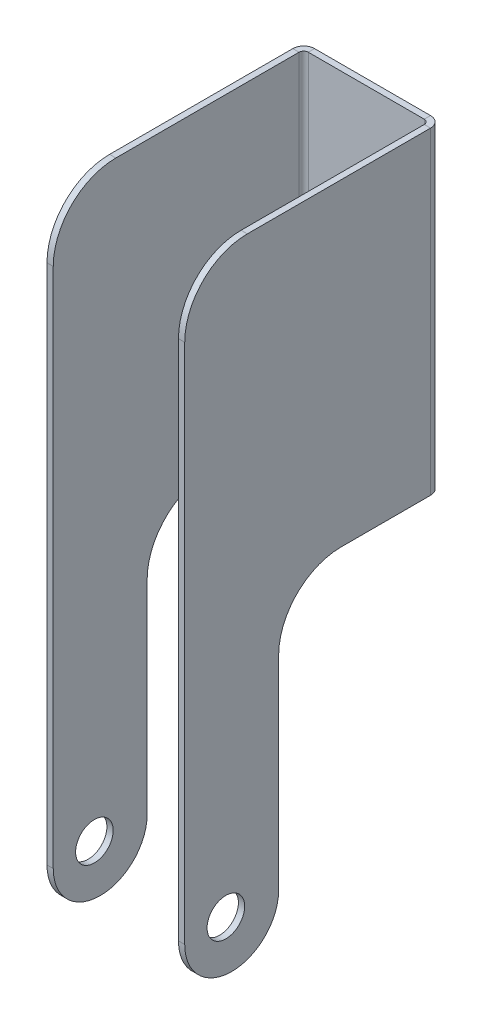
ISO-10303-21;
HEADER;
FILE_DESCRIPTION(('STEP AP214'),'2;1');
FILE_NAME('part.step','',(''),(''),'','','');
FILE_SCHEMA(('AUTOMOTIVE_DESIGN { 1 0 10303 214 1 1 1 1 }'));
ENDSEC;
DATA;
#1=APPLICATION_CONTEXT('core data for automotive mechanical design processes');
#2=APPLICATION_PROTOCOL_DEFINITION('international standard','automotive_design',2000,#1);
#3=PRODUCT_CONTEXT('',#1,'mechanical');
#4=PRODUCT('Part','Part','',(#3));
#5=PRODUCT_RELATED_PRODUCT_CATEGORY('part','',(#4));
#6=PRODUCT_DEFINITION_FORMATION('','',#4);
#7=PRODUCT_DEFINITION_CONTEXT('part definition',#1,'design');
#8=PRODUCT_DEFINITION('design','',#6,#7);
#9=PRODUCT_DEFINITION_SHAPE('','',#8);
#10=(LENGTH_UNIT() NAMED_UNIT(*) SI_UNIT(.MILLI.,.METRE.));
#11=(NAMED_UNIT(*) PLANE_ANGLE_UNIT() SI_UNIT($,.RADIAN.));
#12=(NAMED_UNIT(*) SI_UNIT($,.STERADIAN.) SOLID_ANGLE_UNIT());
#13=UNCERTAINTY_MEASURE_WITH_UNIT(LENGTH_MEASURE(1.E-05),#10,'distance_accuracy_value','');
#14=(GEOMETRIC_REPRESENTATION_CONTEXT(3) GLOBAL_UNCERTAINTY_ASSIGNED_CONTEXT((#13)) GLOBAL_UNIT_ASSIGNED_CONTEXT((#10,
#11,#12)) REPRESENTATION_CONTEXT('',''));
#15=CARTESIAN_POINT('',(0.,0.,0.));
#16=DIRECTION('',(0.,0.,1.));
#17=DIRECTION('',(1.,0.,0.));
#18=AXIS2_PLACEMENT_3D('',#15,#16,#17);
#19=CARTESIAN_POINT('',(11.0000000000001,-25.4,40.));
#20=DIRECTION('',(0.,1.,0.));
#21=DIRECTION('',(0.,0.,1.));
#22=AXIS2_PLACEMENT_3D('',#19,#20,#21);
#23=PLANE('',#22);
#24=DIRECTION('',(0.,0.,-1.));
#25=VECTOR('',#24,1.);
#26=CARTESIAN_POINT('',(11.0000000000001,-25.4,40.));
#27=LINE('',#26,#25);
#28=CARTESIAN_POINT('',(11.0000000000001,-25.4,15.));
#29=VERTEX_POINT('',#28);
#30=CARTESIAN_POINT('',(11.,-25.4,0.736599999999993));
#31=VERTEX_POINT('',#30);
#32=EDGE_CURVE('E216',#29,#31,#27,.T.);
#33=ORIENTED_EDGE('',*,*,#32,.F.);
#34=DIRECTION('',(1.,0.,0.));
#35=VECTOR('',#34,1.);
#36=CARTESIAN_POINT('',(10.0000000000001,-25.4,15.));
#37=LINE('',#36,#35);
#38=CARTESIAN_POINT('',(10.0000000000001,-25.4,15.));
#39=VERTEX_POINT('',#38);
#40=EDGE_CURVE('E316',#29,#39,#37,.F.);
#41=ORIENTED_EDGE('',*,*,#40,.T.);
#42=DIRECTION('',(0.,0.,-1.));
#43=VECTOR('',#42,1.);
#44=CARTESIAN_POINT('',(10.0000000000001,-25.4,40.));
#45=LINE('',#44,#43);
#46=CARTESIAN_POINT('',(10.,-25.4,0.736599999999997));
#47=VERTEX_POINT('',#46);
#48=EDGE_CURVE('E223',#39,#47,#45,.T.);
#49=ORIENTED_EDGE('',*,*,#48,.T.);
#50=DIRECTION('',(1.,0.,0.));
#51=VECTOR('',#50,1.);
#52=CARTESIAN_POINT('',(10.,-25.4,0.736599999999997));
#53=LINE('',#52,#51);
#54=EDGE_CURVE('E399',#47,#31,#53,.T.);
#55=ORIENTED_EDGE('',*,*,#54,.T.);
#56=EDGE_LOOP('',(#33,#41,#49,#55));
#57=FACE_BOUND('',#56,.T.);
#58=ADVANCED_FACE('F38',(#57),#23,.F.);
#59=CARTESIAN_POINT('',(0.,0.,-1.));
#60=DIRECTION('',(0.,0.,-1.));
#61=DIRECTION('',(-1.,0.,0.));
#62=AXIS2_PLACEMENT_3D('',#59,#60,#61);
#63=PLANE('',#62);
#64=DIRECTION('',(-1.,0.,0.));
#65=VECTOR('',#64,1.);
#66=CARTESIAN_POINT('',(-10.,25.4,-1.));
#67=LINE('',#66,#65);
#68=CARTESIAN_POINT('',(9.2634,25.4,-1.));
#69=VERTEX_POINT('',#68);
#70=CARTESIAN_POINT('',(-9.2634,25.4,-1.));
#71=VERTEX_POINT('',#70);
#72=EDGE_CURVE('E297',#69,#71,#67,.T.);
#73=ORIENTED_EDGE('',*,*,#72,.F.);
#74=DIRECTION('',(0.,1.,0.));
#75=VECTOR('',#74,1.);
#76=CARTESIAN_POINT('',(9.2634,25.4,-1.));
#77=LINE('',#76,#75);
#78=CARTESIAN_POINT('',(9.2634,-25.4,-1.));
#79=VERTEX_POINT('',#78);
#80=EDGE_CURVE('E193',#69,#79,#77,.F.);
#81=ORIENTED_EDGE('',*,*,#80,.T.);
#82=DIRECTION('',(1.,0.,0.));
#83=VECTOR('',#82,1.);
#84=CARTESIAN_POINT('',(-10.,-25.4,-1.));
#85=LINE('',#84,#83);
#86=CARTESIAN_POINT('',(-9.2634,-25.4,-1.));
#87=VERTEX_POINT('',#86);
#88=EDGE_CURVE('E300',#87,#79,#85,.T.);
#89=ORIENTED_EDGE('',*,*,#88,.F.);
#90=DIRECTION('',(0.,-1.,0.));
#91=VECTOR('',#90,1.);
#92=CARTESIAN_POINT('',(-9.2634,-25.4,-1.));
#93=LINE('',#92,#91);
#94=EDGE_CURVE('E274',#87,#71,#93,.F.);
#95=ORIENTED_EDGE('',*,*,#94,.T.);
#96=EDGE_LOOP('',(#73,#81,#89,#95));
#97=FACE_BOUND('',#96,.T.);
#98=ADVANCED_FACE('F459',(#97),#63,.T.);
#99=CARTESIAN_POINT('',(0.,0.,0.));
#100=DIRECTION('',(0.,0.,-1.));
#101=DIRECTION('',(-1.,0.,0.));
#102=AXIS2_PLACEMENT_3D('',#99,#100,#101);
#103=PLANE('',#102);
#104=DIRECTION('',(0.,1.,0.));
#105=VECTOR('',#104,1.);
#106=CARTESIAN_POINT('',(9.2634,25.4,0.));
#107=LINE('',#106,#105);
#108=CARTESIAN_POINT('',(9.2634,25.4,0.));
#109=VERTEX_POINT('',#108);
#110=CARTESIAN_POINT('',(9.2634,-25.4,0.));
#111=VERTEX_POINT('',#110);
#112=EDGE_CURVE('E241',#109,#111,#107,.F.);
#113=ORIENTED_EDGE('',*,*,#112,.F.);
#114=DIRECTION('',(-1.,0.,0.));
#115=VECTOR('',#114,1.);
#116=CARTESIAN_POINT('',(-10.,25.4,0.));
#117=LINE('',#116,#115);
#118=CARTESIAN_POINT('',(-9.2634,25.4,0.));
#119=VERTEX_POINT('',#118);
#120=EDGE_CURVE('E294',#109,#119,#117,.T.);
#121=ORIENTED_EDGE('',*,*,#120,.T.);
#122=DIRECTION('',(0.,-1.,0.));
#123=VECTOR('',#122,1.);
#124=CARTESIAN_POINT('',(-9.2634,-25.4,0.));
#125=LINE('',#124,#123);
#126=CARTESIAN_POINT('',(-9.2634,-25.4,0.));
#127=VERTEX_POINT('',#126);
#128=EDGE_CURVE('E287',#127,#119,#125,.F.);
#129=ORIENTED_EDGE('',*,*,#128,.F.);
#130=DIRECTION('',(1.,0.,0.));
#131=VECTOR('',#130,1.);
#132=CARTESIAN_POINT('',(-10.,-25.4,0.));
#133=LINE('',#132,#131);
#134=EDGE_CURVE('E301',#127,#111,#133,.T.);
#135=ORIENTED_EDGE('',*,*,#134,.T.);
#136=EDGE_LOOP('',(#113,#121,#129,#135));
#137=FACE_BOUND('',#136,.T.);
#138=ADVANCED_FACE('F464',(#137),#103,.F.);
#139=CARTESIAN_POINT('',(-10.,25.4,-1.));
#140=DIRECTION('',(0.,1.,0.));
#141=DIRECTION('',(0.,0.,1.));
#142=AXIS2_PLACEMENT_3D('',#139,#140,#141);
#143=PLANE('',#142);
#144=ORIENTED_EDGE('',*,*,#120,.F.);
#145=DIRECTION('',(0.,0.,-1.));
#146=VECTOR('',#145,1.);
#147=CARTESIAN_POINT('',(9.2634,25.4,0.));
#148=LINE('',#147,#146);
#149=EDGE_CURVE('E237',#109,#69,#148,.T.);
#150=ORIENTED_EDGE('',*,*,#149,.T.);
#151=ORIENTED_EDGE('',*,*,#72,.T.);
#152=DIRECTION('',(0.,0.,-1.));
#153=VECTOR('',#152,1.);
#154=CARTESIAN_POINT('',(-9.2634,25.4,0.));
#155=LINE('',#154,#153);
#156=EDGE_CURVE('E291',#119,#71,#155,.T.);
#157=ORIENTED_EDGE('',*,*,#156,.F.);
#158=EDGE_LOOP('',(#144,#150,#151,#157));
#159=FACE_BOUND('',#158,.T.);
#160=ADVANCED_FACE('F520',(#159),#143,.T.);
#161=CARTESIAN_POINT('',(-10.,-25.4,-1.));
#162=DIRECTION('',(0.,-1.,0.));
#163=DIRECTION('',(0.,0.,-1.));
#164=AXIS2_PLACEMENT_3D('',#161,#162,#163);
#165=PLANE('',#164);
#166=DIRECTION('',(0.,0.,-1.));
#167=VECTOR('',#166,1.);
#168=CARTESIAN_POINT('',(9.2634,-25.4,0.));
#169=LINE('',#168,#167);
#170=EDGE_CURVE('E244',#111,#79,#169,.T.);
#171=ORIENTED_EDGE('',*,*,#170,.F.);
#172=ORIENTED_EDGE('',*,*,#134,.F.);
#173=DIRECTION('',(0.,0.,-1.));
#174=VECTOR('',#173,1.);
#175=CARTESIAN_POINT('',(-9.2634,-25.4,0.));
#176=LINE('',#175,#174);
#177=EDGE_CURVE('E281',#127,#87,#176,.T.);
#178=ORIENTED_EDGE('',*,*,#177,.T.);
#179=ORIENTED_EDGE('',*,*,#88,.T.);
#180=EDGE_LOOP('',(#171,#172,#178,#179));
#181=FACE_BOUND('',#180,.T.);
#182=ADVANCED_FACE('F513',(#181),#165,.T.);
#183=CARTESIAN_POINT('',(-9.2634,25.4,0.7366));
#184=DIRECTION('',(0.,1.,0.));
#185=DIRECTION('',(0.,0.,1.));
#186=AXIS2_PLACEMENT_3D('',#183,#184,#185);
#187=PLANE('',#186);
#188=DIRECTION('',(-1.,0.,0.));
#189=VECTOR('',#188,1.);
#190=CARTESIAN_POINT('',(-10.,25.4,0.736599999999997));
#191=LINE('',#190,#189);
#192=CARTESIAN_POINT('',(-10.,25.4,0.736599999999997));
#193=VERTEX_POINT('',#192);
#194=CARTESIAN_POINT('',(-11.,25.4,0.736599999999993));
#195=VERTEX_POINT('',#194);
#196=EDGE_CURVE('E247',#193,#195,#191,.T.);
#197=ORIENTED_EDGE('',*,*,#196,.F.);
#198=CARTESIAN_POINT('',(-9.2634,25.4,0.7366));
#199=DIRECTION('',(0.,-1.,0.));
#200=DIRECTION('',(0.,0.,-1.));
#201=AXIS2_PLACEMENT_3D('',#198,#199,#200);
#202=CIRCLE('',#201,0.7366);
#203=EDGE_CURVE('E284',#119,#193,#202,.F.);
#204=ORIENTED_EDGE('',*,*,#203,.F.);
#205=ORIENTED_EDGE('',*,*,#156,.T.);
#206=CARTESIAN_POINT('',(-9.2634,25.4,0.7366));
#207=DIRECTION('',(0.,-1.,0.));
#208=DIRECTION('',(0.,0.,-1.));
#209=AXIS2_PLACEMENT_3D('',#206,#207,#208);
#210=CIRCLE('',#209,1.7366);
#211=EDGE_CURVE('E277',#71,#195,#210,.F.);
#212=ORIENTED_EDGE('',*,*,#211,.T.);
#213=EDGE_LOOP('',(#197,#204,#205,#212));
#214=FACE_BOUND('',#213,.T.);
#215=ADVANCED_FACE('F510',(#214),#187,.T.);
#216=CARTESIAN_POINT('',(-9.2634,-25.4,0.7366));
#217=DIRECTION('',(0.,1.,0.));
#218=DIRECTION('',(0.,0.,1.));
#219=AXIS2_PLACEMENT_3D('',#216,#217,#218);
#220=PLANE('',#219);
#221=CARTESIAN_POINT('',(-9.2634,-25.4,0.7366));
#222=DIRECTION('',(0.,-1.,0.));
#223=DIRECTION('',(0.,0.,-1.));
#224=AXIS2_PLACEMENT_3D('',#221,#222,#223);
#225=CIRCLE('',#224,0.7366);
#226=CARTESIAN_POINT('',(-10.,-25.4,0.736599999999997));
#227=VERTEX_POINT('',#226);
#228=EDGE_CURVE('E268',#227,#127,#225,.T.);
#229=ORIENTED_EDGE('',*,*,#228,.F.);
#230=DIRECTION('',(-1.,0.,0.));
#231=VECTOR('',#230,1.);
#232=CARTESIAN_POINT('',(-10.,-25.4,0.736599999999997));
#233=LINE('',#232,#231);
#234=CARTESIAN_POINT('',(-11.,-25.4,0.736599999999993));
#235=VERTEX_POINT('',#234);
#236=EDGE_CURVE('E251',#227,#235,#233,.T.);
#237=ORIENTED_EDGE('',*,*,#236,.T.);
#238=CARTESIAN_POINT('',(-9.2634,-25.4,0.7366));
#239=DIRECTION('',(0.,-1.,0.));
#240=DIRECTION('',(0.,0.,-1.));
#241=AXIS2_PLACEMENT_3D('',#238,#239,#240);
#242=CIRCLE('',#241,1.7366);
#243=EDGE_CURVE('E278',#235,#87,#242,.T.);
#244=ORIENTED_EDGE('',*,*,#243,.T.);
#245=ORIENTED_EDGE('',*,*,#177,.F.);
#246=EDGE_LOOP('',(#229,#237,#244,#245));
#247=FACE_BOUND('',#246,.T.);
#248=ADVANCED_FACE('F505',(#247),#220,.F.);
#249=CARTESIAN_POINT('',(-9.2634,-25.4,0.7366));
#250=DIRECTION('',(0.,-1.,0.));
#251=DIRECTION('',(-1.,0.,0.));
#252=AXIS2_PLACEMENT_3D('',#249,#250,#251);
#253=CYLINDRICAL_SURFACE('',#252,1.7366);
#254=ORIENTED_EDGE('',*,*,#94,.F.);
#255=ORIENTED_EDGE('',*,*,#243,.F.);
#256=DIRECTION('',(0.,1.,0.));
#257=VECTOR('',#256,1.);
#258=CARTESIAN_POINT('',(-11.,0.,0.736599999999993));
#259=LINE('',#258,#257);
#260=EDGE_CURVE('E254',#235,#195,#259,.T.);
#261=ORIENTED_EDGE('',*,*,#260,.T.);
#262=ORIENTED_EDGE('',*,*,#211,.F.);
#263=EDGE_LOOP('',(#254,#255,#261,#262));
#264=FACE_BOUND('',#263,.T.);
#265=ADVANCED_FACE('F502',(#264),#253,.T.);
#266=CARTESIAN_POINT('',(-9.2634,-25.4,0.7366));
#267=DIRECTION('',(0.,-1.,0.));
#268=DIRECTION('',(-1.,0.,0.));
#269=AXIS2_PLACEMENT_3D('',#266,#267,#268);
#270=CYLINDRICAL_SURFACE('',#269,0.7366);
#271=ORIENTED_EDGE('',*,*,#128,.T.);
#272=ORIENTED_EDGE('',*,*,#203,.T.);
#273=DIRECTION('',(0.,-1.,0.));
#274=VECTOR('',#273,1.);
#275=CARTESIAN_POINT('',(-10.,25.4,0.736599999999997));
#276=LINE('',#275,#274);
#277=EDGE_CURVE('E249',#193,#227,#276,.T.);
#278=ORIENTED_EDGE('',*,*,#277,.T.);
#279=ORIENTED_EDGE('',*,*,#228,.T.);
#280=EDGE_LOOP('',(#271,#272,#278,#279));
#281=FACE_BOUND('',#280,.T.);
#282=ADVANCED_FACE('F500',(#281),#270,.F.);
#283=CARTESIAN_POINT('',(-11.0000000000001,-25.4,40.));
#284=DIRECTION('',(0.,1.,0.));
#285=DIRECTION('',(0.,0.,1.));
#286=AXIS2_PLACEMENT_3D('',#283,#284,#285);
#287=PLANE('',#286);
#288=DIRECTION('',(0.,0.,1.));
#289=VECTOR('',#288,1.);
#290=CARTESIAN_POINT('',(-10.0000000000001,-25.4,40.));
#291=LINE('',#290,#289);
#292=CARTESIAN_POINT('',(-10.,-25.4,15.));
#293=VERTEX_POINT('',#292);
#294=EDGE_CURVE('E259',#227,#293,#291,.T.);
#295=ORIENTED_EDGE('',*,*,#294,.T.);
#296=DIRECTION('',(-1.,0.,0.));
#297=VECTOR('',#296,1.);
#298=CARTESIAN_POINT('',(-11.,-25.4,15.));
#299=LINE('',#298,#297);
#300=CARTESIAN_POINT('',(-11.,-25.4,15.));
#301=VERTEX_POINT('',#300);
#302=EDGE_CURVE('E318',#293,#301,#299,.T.);
#303=ORIENTED_EDGE('',*,*,#302,.T.);
#304=DIRECTION('',(0.,0.,1.));
#305=VECTOR('',#304,1.);
#306=CARTESIAN_POINT('',(-11.0000000000001,-25.4,40.));
#307=LINE('',#306,#305);
#308=EDGE_CURVE('E260',#235,#301,#307,.T.);
#309=ORIENTED_EDGE('',*,*,#308,.F.);
#310=ORIENTED_EDGE('',*,*,#236,.F.);
#311=EDGE_LOOP('',(#295,#303,#309,#310));
#312=FACE_BOUND('',#311,.T.);
#313=ADVANCED_FACE('F493',(#312),#287,.F.);
#314=CARTESIAN_POINT('',(-11.,25.4,0.));
#315=DIRECTION('',(0.,-1.,0.));
#316=DIRECTION('',(0.,0.,-1.));
#317=AXIS2_PLACEMENT_3D('',#314,#315,#316);
#318=PLANE('',#317);
#319=DIRECTION('',(0.,0.,-1.));
#320=VECTOR('',#319,1.);
#321=CARTESIAN_POINT('',(-11.,25.4,0.));
#322=LINE('',#321,#320);
#323=CARTESIAN_POINT('',(-11.0000000000001,25.4,30.));
#324=VERTEX_POINT('',#323);
#325=EDGE_CURVE('E266',#324,#195,#322,.T.);
#326=ORIENTED_EDGE('',*,*,#325,.F.);
#327=DIRECTION('',(1.,0.,0.));
#328=VECTOR('',#327,1.);
#329=CARTESIAN_POINT('',(-11.0000000000001,25.4,30.));
#330=LINE('',#329,#328);
#331=CARTESIAN_POINT('',(-10.0000000000001,25.4,30.));
#332=VERTEX_POINT('',#331);
#333=EDGE_CURVE('E331',#324,#332,#330,.T.);
#334=ORIENTED_EDGE('',*,*,#333,.T.);
#335=DIRECTION('',(0.,0.,-1.));
#336=VECTOR('',#335,1.);
#337=CARTESIAN_POINT('',(-10.,25.4,0.));
#338=LINE('',#337,#336);
#339=EDGE_CURVE('E264',#332,#193,#338,.T.);
#340=ORIENTED_EDGE('',*,*,#339,.T.);
#341=ORIENTED_EDGE('',*,*,#196,.T.);
#342=EDGE_LOOP('',(#326,#334,#340,#341));
#343=FACE_BOUND('',#342,.T.);
#344=ADVANCED_FACE('F486',(#343),#318,.F.);
#345=CARTESIAN_POINT('',(-11.,0.,0.));
#346=DIRECTION('',(1.,0.,0.));
#347=DIRECTION('',(0.,0.,-1.));
#348=AXIS2_PLACEMENT_3D('',#345,#346,#347);
#349=PLANE('',#348);
#350=CARTESIAN_POINT('',(-11.0000000000001,-67.4,33.4285));
#351=DIRECTION('',(-1.,0.,0.));
#352=DIRECTION('',(0.,0.,1.));
#353=AXIS2_PLACEMENT_3D('',#350,#351,#352);
#354=CIRCLE('',#353,3.);
#355=CARTESIAN_POINT('',(-11.0000000000001,-67.4,36.4285));
#356=VERTEX_POINT('',#355);
#357=EDGE_CURVE('E373',#356,#356,#354,.T.);
#358=ORIENTED_EDGE('',*,*,#357,.F.);
#359=EDGE_LOOP('',(#358));
#360=FACE_BOUND('',#359,.T.);
#361=CARTESIAN_POINT('',(-11.0000000000001,-67.9,32.5));
#362=DIRECTION('',(1.,0.,0.));
#363=DIRECTION('',(0.,0.,-1.));
#364=AXIS2_PLACEMENT_3D('',#361,#362,#363);
#365=CIRCLE('',#364,7.5);
#366=CARTESIAN_POINT('',(-11.0000000000001,-67.9,25.));
#367=VERTEX_POINT('',#366);
#368=CARTESIAN_POINT('',(-11.0000000000001,-75.4,32.5));
#369=VERTEX_POINT('',#368);
#370=EDGE_CURVE('E363',#367,#369,#365,.F.);
#371=ORIENTED_EDGE('',*,*,#370,.T.);
#372=CARTESIAN_POINT('',(-11.0000000000001,-67.9,32.5));
#373=DIRECTION('',(1.,0.,0.));
#374=DIRECTION('',(0.,0.,-1.));
#375=AXIS2_PLACEMENT_3D('',#372,#373,#374);
#376=CIRCLE('',#375,7.5);
#377=CARTESIAN_POINT('',(-11.0000000000001,-67.9,40.));
#378=VERTEX_POINT('',#377);
#379=EDGE_CURVE('E365',#369,#378,#376,.F.);
#380=ORIENTED_EDGE('',*,*,#379,.T.);
#381=DIRECTION('',(0.,1.,0.));
#382=VECTOR('',#381,1.);
#383=CARTESIAN_POINT('',(-11.0000000000001,25.4,40.));
#384=LINE('',#383,#382);
#385=CARTESIAN_POINT('',(-11.0000000000001,15.4,40.));
#386=VERTEX_POINT('',#385);
#387=EDGE_CURVE('E263',#378,#386,#384,.T.);
#388=ORIENTED_EDGE('',*,*,#387,.T.);
#389=CARTESIAN_POINT('',(-11.0000000000001,15.4,30.));
#390=DIRECTION('',(1.,0.,0.));
#391=DIRECTION('',(0.,0.,-1.));
#392=AXIS2_PLACEMENT_3D('',#389,#390,#391);
#393=CIRCLE('',#392,10.);
#394=EDGE_CURVE('E340',#386,#324,#393,.F.);
#395=ORIENTED_EDGE('',*,*,#394,.T.);
#396=ORIENTED_EDGE('',*,*,#325,.T.);
#397=ORIENTED_EDGE('',*,*,#260,.F.);
#398=ORIENTED_EDGE('',*,*,#308,.T.);
#399=CARTESIAN_POINT('',(-11.0000000000001,-35.4,15.));
#400=DIRECTION('',(1.,0.,0.));
#401=DIRECTION('',(0.,0.,-1.));
#402=AXIS2_PLACEMENT_3D('',#399,#400,#401);
#403=CIRCLE('',#402,10.);
#404=CARTESIAN_POINT('',(-11.0000000000001,-35.4,25.));
#405=VERTEX_POINT('',#404);
#406=EDGE_CURVE('E346',#301,#405,#403,.T.);
#407=ORIENTED_EDGE('',*,*,#406,.T.);
#408=DIRECTION('',(0.,-1.,0.));
#409=VECTOR('',#408,1.);
#410=CARTESIAN_POINT('',(-11.0000000000001,-75.4,25.));
#411=LINE('',#410,#409);
#412=EDGE_CURVE('E392',#405,#367,#411,.T.);
#413=ORIENTED_EDGE('',*,*,#412,.T.);
#414=EDGE_LOOP('',(#371,#380,#388,#395,#396,#397,#398,#407,#413));
#415=FACE_BOUND('',#414,.T.);
#416=ADVANCED_FACE('F396',(#360,#415),#349,.F.);
#417=CARTESIAN_POINT('',(-10.,0.,0.));
#418=DIRECTION('',(1.,0.,0.));
#419=DIRECTION('',(0.,0.,-1.));
#420=AXIS2_PLACEMENT_3D('',#417,#418,#419);
#421=PLANE('',#420);
#422=CARTESIAN_POINT('',(-10.0000000000001,-67.4,33.4285));
#423=DIRECTION('',(1.,0.,0.));
#424=DIRECTION('',(0.,0.,-1.));
#425=AXIS2_PLACEMENT_3D('',#422,#423,#424);
#426=CIRCLE('',#425,3.);
#427=CARTESIAN_POINT('',(-10.0000000000001,-67.4,30.4285));
#428=VERTEX_POINT('',#427);
#429=EDGE_CURVE('E312',#428,#428,#426,.T.);
#430=ORIENTED_EDGE('',*,*,#429,.F.);
#431=EDGE_LOOP('',(#430));
#432=FACE_BOUND('',#431,.T.);
#433=DIRECTION('',(0.,1.,0.));
#434=VECTOR('',#433,1.);
#435=CARTESIAN_POINT('',(-10.0000000000001,25.4,40.));
#436=LINE('',#435,#434);
#437=CARTESIAN_POINT('',(-10.0000000000001,-67.9,40.));
#438=VERTEX_POINT('',#437);
#439=CARTESIAN_POINT('',(-10.0000000000001,15.4,40.));
#440=VERTEX_POINT('',#439);
#441=EDGE_CURVE('E271',#438,#440,#436,.T.);
#442=ORIENTED_EDGE('',*,*,#441,.F.);
#443=CARTESIAN_POINT('',(-10.0000000000001,-67.9,32.5));
#444=DIRECTION('',(1.,0.,0.));
#445=DIRECTION('',(0.,0.,-1.));
#446=AXIS2_PLACEMENT_3D('',#443,#444,#445);
#447=CIRCLE('',#446,7.5);
#448=CARTESIAN_POINT('',(-10.0000000000001,-75.4,32.5));
#449=VERTEX_POINT('',#448);
#450=EDGE_CURVE('E47',#438,#449,#447,.T.);
#451=ORIENTED_EDGE('',*,*,#450,.T.);
#452=CARTESIAN_POINT('',(-10.0000000000001,-67.9,32.5));
#453=DIRECTION('',(1.,0.,0.));
#454=DIRECTION('',(0.,0.,-1.));
#455=AXIS2_PLACEMENT_3D('',#452,#453,#454);
#456=CIRCLE('',#455,7.5);
#457=CARTESIAN_POINT('',(-10.0000000000001,-67.9,25.));
#458=VERTEX_POINT('',#457);
#459=EDGE_CURVE('E55',#449,#458,#456,.T.);
#460=ORIENTED_EDGE('',*,*,#459,.T.);
#461=DIRECTION('',(0.,-1.,0.));
#462=VECTOR('',#461,1.);
#463=CARTESIAN_POINT('',(-10.0000000000001,-75.4,25.));
#464=LINE('',#463,#462);
#465=CARTESIAN_POINT('',(-10.0000000000001,-35.4,25.));
#466=VERTEX_POINT('',#465);
#467=EDGE_CURVE('E394',#466,#458,#464,.T.);
#468=ORIENTED_EDGE('',*,*,#467,.F.);
#469=CARTESIAN_POINT('',(-10.,-35.4,15.));
#470=DIRECTION('',(1.,0.,0.));
#471=DIRECTION('',(0.,0.,-1.));
#472=AXIS2_PLACEMENT_3D('',#469,#470,#471);
#473=CIRCLE('',#472,10.);
#474=EDGE_CURVE('E348',#466,#293,#473,.F.);
#475=ORIENTED_EDGE('',*,*,#474,.T.);
#476=ORIENTED_EDGE('',*,*,#294,.F.);
#477=ORIENTED_EDGE('',*,*,#277,.F.);
#478=ORIENTED_EDGE('',*,*,#339,.F.);
#479=CARTESIAN_POINT('',(-10.0000000000001,15.4,30.));
#480=DIRECTION('',(1.,0.,0.));
#481=DIRECTION('',(0.,0.,-1.));
#482=AXIS2_PLACEMENT_3D('',#479,#480,#481);
#483=CIRCLE('',#482,10.);
#484=EDGE_CURVE('E334',#332,#440,#483,.T.);
#485=ORIENTED_EDGE('',*,*,#484,.T.);
#486=EDGE_LOOP('',(#442,#451,#460,#468,#475,#476,#477,#478,#485));
#487=FACE_BOUND('',#486,.T.);
#488=ADVANCED_FACE('F485',(#432,#487),#421,.T.);
#489=CARTESIAN_POINT('',(-11.0000000000001,25.4,40.));
#490=DIRECTION('',(0.,0.,-1.));
#491=DIRECTION('',(-1.,0.,0.));
#492=AXIS2_PLACEMENT_3D('',#489,#490,#491);
#493=PLANE('',#492);
#494=ORIENTED_EDGE('',*,*,#387,.F.);
#495=DIRECTION('',(-1.,0.,0.));
#496=VECTOR('',#495,1.);
#497=CARTESIAN_POINT('',(-10.0000000000001,-67.9,40.));
#498=LINE('',#497,#496);
#499=EDGE_CURVE('E367',#378,#438,#498,.F.);
#500=ORIENTED_EDGE('',*,*,#499,.T.);
#501=ORIENTED_EDGE('',*,*,#441,.T.);
#502=DIRECTION('',(1.,0.,0.));
#503=VECTOR('',#502,1.);
#504=CARTESIAN_POINT('',(-11.0000000000001,15.4,40.));
#505=LINE('',#504,#503);
#506=EDGE_CURVE('E337',#440,#386,#505,.F.);
#507=ORIENTED_EDGE('',*,*,#506,.T.);
#508=EDGE_LOOP('',(#494,#500,#501,#507));
#509=FACE_BOUND('',#508,.T.);
#510=ADVANCED_FACE('F480',(#509),#493,.F.);
#511=CARTESIAN_POINT('',(9.2634,-25.4,0.7366));
#512=DIRECTION('',(0.,-1.,0.));
#513=DIRECTION('',(0.,0.,-1.));
#514=AXIS2_PLACEMENT_3D('',#511,#512,#513);
#515=PLANE('',#514);
#516=ORIENTED_EDGE('',*,*,#54,.F.);
#517=CARTESIAN_POINT('',(9.2634,-25.4,0.7366));
#518=DIRECTION('',(0.,1.,0.));
#519=DIRECTION('',(0.,0.,1.));
#520=AXIS2_PLACEMENT_3D('',#517,#518,#519);
#521=CIRCLE('',#520,0.7366);
#522=EDGE_CURVE('E196',#111,#47,#521,.F.);
#523=ORIENTED_EDGE('',*,*,#522,.F.);
#524=ORIENTED_EDGE('',*,*,#170,.T.);
#525=CARTESIAN_POINT('',(9.2634,-25.4,0.7366));
#526=DIRECTION('',(0.,1.,0.));
#527=DIRECTION('',(0.,0.,1.));
#528=AXIS2_PLACEMENT_3D('',#525,#526,#527);
#529=CIRCLE('',#528,1.7366);
#530=EDGE_CURVE('E236',#79,#31,#529,.F.);
#531=ORIENTED_EDGE('',*,*,#530,.T.);
#532=EDGE_LOOP('',(#516,#523,#524,#531));
#533=FACE_BOUND('',#532,.T.);
#534=ADVANCED_FACE('F413',(#533),#515,.T.);
#535=CARTESIAN_POINT('',(9.2634,25.4,0.7366));
#536=DIRECTION('',(0.,-1.,0.));
#537=DIRECTION('',(0.,0.,-1.));
#538=AXIS2_PLACEMENT_3D('',#535,#536,#537);
#539=PLANE('',#538);
#540=CARTESIAN_POINT('',(9.2634,25.4,0.7366));
#541=DIRECTION('',(0.,1.,0.));
#542=DIRECTION('',(0.,0.,1.));
#543=AXIS2_PLACEMENT_3D('',#540,#541,#542);
#544=CIRCLE('',#543,0.7366);
#545=CARTESIAN_POINT('',(10.,25.4,0.736599999999997));
#546=VERTEX_POINT('',#545);
#547=EDGE_CURVE('E203',#546,#109,#544,.T.);
#548=ORIENTED_EDGE('',*,*,#547,.F.);
#549=DIRECTION('',(1.,0.,0.));
#550=VECTOR('',#549,1.);
#551=CARTESIAN_POINT('',(10.,25.4,0.736599999999997));
#552=LINE('',#551,#550);
#553=CARTESIAN_POINT('',(11.,25.4,0.736599999999993));
#554=VERTEX_POINT('',#553);
#555=EDGE_CURVE('E200',#546,#554,#552,.T.);
#556=ORIENTED_EDGE('',*,*,#555,.T.);
#557=CARTESIAN_POINT('',(9.2634,25.4,0.7366));
#558=DIRECTION('',(0.,1.,0.));
#559=DIRECTION('',(0.,0.,1.));
#560=AXIS2_PLACEMENT_3D('',#557,#558,#559);
#561=CIRCLE('',#560,1.7366);
#562=EDGE_CURVE('E186',#554,#69,#561,.T.);
#563=ORIENTED_EDGE('',*,*,#562,.T.);
#564=ORIENTED_EDGE('',*,*,#149,.F.);
#565=EDGE_LOOP('',(#548,#556,#563,#564));
#566=FACE_BOUND('',#565,.T.);
#567=ADVANCED_FACE('F201',(#566),#539,.F.);
#568=CARTESIAN_POINT('',(9.2634,25.4,0.7366));
#569=DIRECTION('',(0.,1.,0.));
#570=DIRECTION('',(1.,0.,0.));
#571=AXIS2_PLACEMENT_3D('',#568,#569,#570);
#572=CYLINDRICAL_SURFACE('',#571,1.7366);
#573=ORIENTED_EDGE('',*,*,#80,.F.);
#574=ORIENTED_EDGE('',*,*,#562,.F.);
#575=DIRECTION('',(0.,1.,0.));
#576=VECTOR('',#575,1.);
#577=CARTESIAN_POINT('',(11.,0.,0.736599999999993));
#578=LINE('',#577,#576);
#579=EDGE_CURVE('E190',#31,#554,#578,.T.);
#580=ORIENTED_EDGE('',*,*,#579,.F.);
#581=ORIENTED_EDGE('',*,*,#530,.F.);
#582=EDGE_LOOP('',(#573,#574,#580,#581));
#583=FACE_BOUND('',#582,.T.);
#584=ADVANCED_FACE('F188',(#583),#572,.T.);
#585=CARTESIAN_POINT('',(9.2634,25.4,0.7366));
#586=DIRECTION('',(0.,1.,0.));
#587=DIRECTION('',(1.,0.,0.));
#588=AXIS2_PLACEMENT_3D('',#585,#586,#587);
#589=CYLINDRICAL_SURFACE('',#588,0.7366);
#590=ORIENTED_EDGE('',*,*,#112,.T.);
#591=ORIENTED_EDGE('',*,*,#522,.T.);
#592=DIRECTION('',(0.,1.,0.));
#593=VECTOR('',#592,1.);
#594=CARTESIAN_POINT('',(10.,-25.4,0.736599999999997));
#595=LINE('',#594,#593);
#596=EDGE_CURVE('E208',#47,#546,#595,.T.);
#597=ORIENTED_EDGE('',*,*,#596,.T.);
#598=ORIENTED_EDGE('',*,*,#547,.T.);
#599=EDGE_LOOP('',(#590,#591,#597,#598));
#600=FACE_BOUND('',#599,.T.);
#601=ADVANCED_FACE('F417',(#600),#589,.F.);
#602=CARTESIAN_POINT('',(11.,25.4,0.));
#603=DIRECTION('',(0.,-1.,0.));
#604=DIRECTION('',(0.,0.,-1.));
#605=AXIS2_PLACEMENT_3D('',#602,#603,#604);
#606=PLANE('',#605);
#607=DIRECTION('',(0.,0.,1.));
#608=VECTOR('',#607,1.);
#609=CARTESIAN_POINT('',(10.,25.4,0.));
#610=LINE('',#609,#608);
#611=CARTESIAN_POINT('',(10.0000000000001,25.4,30.));
#612=VERTEX_POINT('',#611);
#613=EDGE_CURVE('E217',#546,#612,#610,.T.);
#614=ORIENTED_EDGE('',*,*,#613,.T.);
#615=DIRECTION('',(-1.,0.,0.));
#616=VECTOR('',#615,1.);
#617=CARTESIAN_POINT('',(11.0000000000001,25.4,30.));
#618=LINE('',#617,#616);
#619=CARTESIAN_POINT('',(11.0000000000001,25.4,30.));
#620=VERTEX_POINT('',#619);
#621=EDGE_CURVE('E221',#612,#620,#618,.F.);
#622=ORIENTED_EDGE('',*,*,#621,.T.);
#623=DIRECTION('',(0.,0.,1.));
#624=VECTOR('',#623,1.);
#625=CARTESIAN_POINT('',(11.,25.4,0.));
#626=LINE('',#625,#624);
#627=EDGE_CURVE('E213',#554,#620,#626,.T.);
#628=ORIENTED_EDGE('',*,*,#627,.F.);
#629=ORIENTED_EDGE('',*,*,#555,.F.);
#630=EDGE_LOOP('',(#614,#622,#628,#629));
#631=FACE_BOUND('',#630,.T.);
#632=ADVANCED_FACE('F219',(#631),#606,.F.);
#633=CARTESIAN_POINT('',(11.,0.,0.));
#634=DIRECTION('',(1.,0.,0.));
#635=DIRECTION('',(0.,0.,-1.));
#636=AXIS2_PLACEMENT_3D('',#633,#634,#635);
#637=PLANE('',#636);
#638=CARTESIAN_POINT('',(11.0000000000002,-67.4,33.4285000000001));
#639=DIRECTION('',(-1.,0.,0.));
#640=DIRECTION('',(0.,0.,1.));
#641=AXIS2_PLACEMENT_3D('',#638,#639,#640);
#642=CIRCLE('',#641,3.);
#643=CARTESIAN_POINT('',(11.0000000000002,-67.4,36.4285000000001));
#644=VERTEX_POINT('',#643);
#645=EDGE_CURVE('E313',#644,#644,#642,.T.);
#646=ORIENTED_EDGE('',*,*,#645,.T.);
#647=EDGE_LOOP('',(#646));
#648=FACE_BOUND('',#647,.T.);
#649=CARTESIAN_POINT('',(11.0000000000001,-67.9,32.5));
#650=DIRECTION('',(1.,0.,0.));
#651=DIRECTION('',(0.,0.,-1.));
#652=AXIS2_PLACEMENT_3D('',#649,#650,#651);
#653=CIRCLE('',#652,7.5);
#654=CARTESIAN_POINT('',(11.0000000000001,-67.9,40.));
#655=VERTEX_POINT('',#654);
#656=CARTESIAN_POINT('',(11.0000000000001,-75.4,32.5));
#657=VERTEX_POINT('',#656);
#658=EDGE_CURVE('E350',#655,#657,#653,.T.);
#659=ORIENTED_EDGE('',*,*,#658,.T.);
#660=CARTESIAN_POINT('',(11.0000000000001,-67.9,32.5));
#661=DIRECTION('',(1.,0.,0.));
#662=DIRECTION('',(0.,0.,-1.));
#663=AXIS2_PLACEMENT_3D('',#660,#661,#662);
#664=CIRCLE('',#663,7.5);
#665=CARTESIAN_POINT('',(11.0000000000001,-67.9,25.));
#666=VERTEX_POINT('',#665);
#667=EDGE_CURVE('E352',#657,#666,#664,.T.);
#668=ORIENTED_EDGE('',*,*,#667,.T.);
#669=DIRECTION('',(0.,-1.,0.));
#670=VECTOR('',#669,1.);
#671=CARTESIAN_POINT('',(11.0000000000001,-75.4,25.));
#672=LINE('',#671,#670);
#673=CARTESIAN_POINT('',(11.0000000000001,-35.4,25.));
#674=VERTEX_POINT('',#673);
#675=EDGE_CURVE('E402',#674,#666,#672,.T.);
#676=ORIENTED_EDGE('',*,*,#675,.F.);
#677=CARTESIAN_POINT('',(11.0000000000001,-35.4,15.));
#678=DIRECTION('',(1.,0.,0.));
#679=DIRECTION('',(0.,0.,-1.));
#680=AXIS2_PLACEMENT_3D('',#677,#678,#679);
#681=CIRCLE('',#680,10.);
#682=EDGE_CURVE('E342',#674,#29,#681,.F.);
#683=ORIENTED_EDGE('',*,*,#682,.T.);
#684=ORIENTED_EDGE('',*,*,#32,.T.);
#685=ORIENTED_EDGE('',*,*,#579,.T.);
#686=ORIENTED_EDGE('',*,*,#627,.T.);
#687=CARTESIAN_POINT('',(11.0000000000001,15.4,30.));
#688=DIRECTION('',(1.,0.,0.));
#689=DIRECTION('',(0.,0.,-1.));
#690=AXIS2_PLACEMENT_3D('',#687,#688,#689);
#691=CIRCLE('',#690,10.);
#692=CARTESIAN_POINT('',(11.0000000000001,15.4,40.));
#693=VERTEX_POINT('',#692);
#694=EDGE_CURVE('E329',#620,#693,#691,.T.);
#695=ORIENTED_EDGE('',*,*,#694,.T.);
#696=DIRECTION('',(0.,-1.,0.));
#697=VECTOR('',#696,1.);
#698=CARTESIAN_POINT('',(11.0000000000001,25.4,40.));
#699=LINE('',#698,#697);
#700=EDGE_CURVE('E222',#693,#655,#699,.T.);
#701=ORIENTED_EDGE('',*,*,#700,.T.);
#702=EDGE_LOOP('',(#659,#668,#676,#683,#684,#685,#686,#695,#701));
#703=FACE_BOUND('',#702,.T.);
#704=ADVANCED_FACE('F212',(#648,#703),#637,.T.);
#705=CARTESIAN_POINT('',(10.,0.,0.));
#706=DIRECTION('',(1.,0.,0.));
#707=DIRECTION('',(0.,0.,-1.));
#708=AXIS2_PLACEMENT_3D('',#705,#706,#707);
#709=PLANE('',#708);
#710=CARTESIAN_POINT('',(10.0000000000001,-67.4,33.4285000000001));
#711=DIRECTION('',(1.,0.,0.));
#712=DIRECTION('',(0.,0.,-1.));
#713=AXIS2_PLACEMENT_3D('',#710,#711,#712);
#714=CIRCLE('',#713,3.);
#715=CARTESIAN_POINT('',(10.0000000000001,-67.4,30.4285000000001));
#716=VERTEX_POINT('',#715);
#717=EDGE_CURVE('E309',#716,#716,#714,.T.);
#718=ORIENTED_EDGE('',*,*,#717,.T.);
#719=EDGE_LOOP('',(#718));
#720=FACE_BOUND('',#719,.T.);
#721=DIRECTION('',(0.,-1.,0.));
#722=VECTOR('',#721,1.);
#723=CARTESIAN_POINT('',(10.0000000000001,-75.4,25.));
#724=LINE('',#723,#722);
#725=CARTESIAN_POINT('',(10.0000000000001,-35.4,25.));
#726=VERTEX_POINT('',#725);
#727=CARTESIAN_POINT('',(10.0000000000001,-67.9,25.));
#728=VERTEX_POINT('',#727);
#729=EDGE_CURVE('E397',#726,#728,#724,.T.);
#730=ORIENTED_EDGE('',*,*,#729,.T.);
#731=CARTESIAN_POINT('',(10.0000000000001,-67.9,32.5));
#732=DIRECTION('',(1.,0.,0.));
#733=DIRECTION('',(0.,0.,-1.));
#734=AXIS2_PLACEMENT_3D('',#731,#732,#733);
#735=CIRCLE('',#734,7.5);
#736=CARTESIAN_POINT('',(10.0000000000001,-75.4,32.5));
#737=VERTEX_POINT('',#736);
#738=EDGE_CURVE('E359',#728,#737,#735,.F.);
#739=ORIENTED_EDGE('',*,*,#738,.T.);
#740=CARTESIAN_POINT('',(10.0000000000001,-67.9,32.5));
#741=DIRECTION('',(1.,0.,0.));
#742=DIRECTION('',(0.,0.,-1.));
#743=AXIS2_PLACEMENT_3D('',#740,#741,#742);
#744=CIRCLE('',#743,7.5);
#745=CARTESIAN_POINT('',(10.0000000000001,-67.9,40.));
#746=VERTEX_POINT('',#745);
#747=EDGE_CURVE('E357',#737,#746,#744,.F.);
#748=ORIENTED_EDGE('',*,*,#747,.T.);
#749=DIRECTION('',(0.,-1.,0.));
#750=VECTOR('',#749,1.);
#751=CARTESIAN_POINT('',(10.0000000000001,25.4,40.));
#752=LINE('',#751,#750);
#753=CARTESIAN_POINT('',(10.0000000000001,15.4,40.));
#754=VERTEX_POINT('',#753);
#755=EDGE_CURVE('E227',#754,#746,#752,.T.);
#756=ORIENTED_EDGE('',*,*,#755,.F.);
#757=CARTESIAN_POINT('',(10.0000000000001,15.4,30.));
#758=DIRECTION('',(1.,0.,0.));
#759=DIRECTION('',(0.,0.,-1.));
#760=AXIS2_PLACEMENT_3D('',#757,#758,#759);
#761=CIRCLE('',#760,10.);
#762=EDGE_CURVE('E326',#754,#612,#761,.F.);
#763=ORIENTED_EDGE('',*,*,#762,.T.);
#764=ORIENTED_EDGE('',*,*,#613,.F.);
#765=ORIENTED_EDGE('',*,*,#596,.F.);
#766=ORIENTED_EDGE('',*,*,#48,.F.);
#767=CARTESIAN_POINT('',(10.0000000000001,-35.4,15.));
#768=DIRECTION('',(1.,0.,0.));
#769=DIRECTION('',(0.,0.,-1.));
#770=AXIS2_PLACEMENT_3D('',#767,#768,#769);
#771=CIRCLE('',#770,10.);
#772=EDGE_CURVE('E344',#39,#726,#771,.T.);
#773=ORIENTED_EDGE('',*,*,#772,.T.);
#774=EDGE_LOOP('',(#730,#739,#748,#756,#763,#764,#765,#766,#773));
#775=FACE_BOUND('',#774,.T.);
#776=ADVANCED_FACE('F420',(#720,#775),#709,.F.);
#777=CARTESIAN_POINT('',(11.0000000000001,25.4,40.));
#778=DIRECTION('',(0.,0.,-1.));
#779=DIRECTION('',(-1.,0.,0.));
#780=AXIS2_PLACEMENT_3D('',#777,#778,#779);
#781=PLANE('',#780);
#782=ORIENTED_EDGE('',*,*,#755,.T.);
#783=DIRECTION('',(1.,0.,0.));
#784=VECTOR('',#783,1.);
#785=CARTESIAN_POINT('',(11.0000000000001,-67.9,40.));
#786=LINE('',#785,#784);
#787=EDGE_CURVE('E361',#746,#655,#786,.T.);
#788=ORIENTED_EDGE('',*,*,#787,.T.);
#789=ORIENTED_EDGE('',*,*,#700,.F.);
#790=DIRECTION('',(-1.,0.,0.));
#791=VECTOR('',#790,1.);
#792=CARTESIAN_POINT('',(11.0000000000001,15.4,40.));
#793=LINE('',#792,#791);
#794=EDGE_CURVE('E323',#693,#754,#793,.T.);
#795=ORIENTED_EDGE('',*,*,#794,.T.);
#796=EDGE_LOOP('',(#782,#788,#789,#795));
#797=FACE_BOUND('',#796,.T.);
#798=ADVANCED_FACE('F429',(#797),#781,.F.);
#799=CARTESIAN_POINT('',(-10.0000000000001,-75.4,25.));
#800=DIRECTION('',(0.,0.,-1.));
#801=DIRECTION('',(-1.,0.,0.));
#802=AXIS2_PLACEMENT_3D('',#799,#800,#801);
#803=PLANE('',#802);
#804=ORIENTED_EDGE('',*,*,#467,.T.);
#805=DIRECTION('',(-1.,0.,0.));
#806=VECTOR('',#805,1.);
#807=CARTESIAN_POINT('',(-10.0000000000001,-67.9,25.));
#808=LINE('',#807,#806);
#809=EDGE_CURVE('E11',#458,#367,#808,.T.);
#810=ORIENTED_EDGE('',*,*,#809,.T.);
#811=ORIENTED_EDGE('',*,*,#412,.F.);
#812=DIRECTION('',(-1.,0.,0.));
#813=VECTOR('',#812,1.);
#814=CARTESIAN_POINT('',(-10.0000000000001,-35.4,25.));
#815=LINE('',#814,#813);
#816=EDGE_CURVE('E321',#405,#466,#815,.F.);
#817=ORIENTED_EDGE('',*,*,#816,.T.);
#818=EDGE_LOOP('',(#804,#810,#811,#817));
#819=FACE_BOUND('',#818,.T.);
#820=ADVANCED_FACE('F391',(#819),#803,.T.);
#821=CARTESIAN_POINT('',(10.0000000000001,-75.4,25.));
#822=DIRECTION('',(0.,0.,1.));
#823=DIRECTION('',(1.,0.,0.));
#824=AXIS2_PLACEMENT_3D('',#821,#822,#823);
#825=PLANE('',#824);
#826=ORIENTED_EDGE('',*,*,#675,.T.);
#827=DIRECTION('',(1.,0.,0.));
#828=VECTOR('',#827,1.);
#829=CARTESIAN_POINT('',(10.0000000000001,-67.9,25.));
#830=LINE('',#829,#828);
#831=EDGE_CURVE('E354',#666,#728,#830,.F.);
#832=ORIENTED_EDGE('',*,*,#831,.T.);
#833=ORIENTED_EDGE('',*,*,#729,.F.);
#834=DIRECTION('',(1.,0.,0.));
#835=VECTOR('',#834,1.);
#836=CARTESIAN_POINT('',(11.0000000000001,-35.4,25.));
#837=LINE('',#836,#835);
#838=EDGE_CURVE('E304',#726,#674,#837,.T.);
#839=ORIENTED_EDGE('',*,*,#838,.T.);
#840=EDGE_LOOP('',(#826,#832,#833,#839));
#841=FACE_BOUND('',#840,.T.);
#842=ADVANCED_FACE('F438',(#841),#825,.F.);
#843=CARTESIAN_POINT('',(11.0000000000002,-67.4,33.4285000000001));
#844=DIRECTION('',(-1.,0.,0.));
#845=DIRECTION('',(0.,0.,1.));
#846=AXIS2_PLACEMENT_3D('',#843,#844,#845);
#847=CYLINDRICAL_SURFACE('',#846,3.);
#848=ORIENTED_EDGE('',*,*,#645,.F.);
#849=EDGE_LOOP('',(#848));
#850=FACE_BOUND('',#849,.T.);
#851=ORIENTED_EDGE('',*,*,#717,.F.);
#852=EDGE_LOOP('',(#851));
#853=FACE_BOUND('',#852,.T.);
#854=ADVANCED_FACE('F454',(#850,#853),#847,.F.);
#855=ORIENTED_EDGE('',*,*,#429,.T.);
#856=EDGE_LOOP('',(#855));
#857=FACE_BOUND('',#856,.T.);
#858=ORIENTED_EDGE('',*,*,#357,.T.);
#859=EDGE_LOOP('',(#858));
#860=FACE_BOUND('',#859,.T.);
#861=ADVANCED_FACE('F446',(#857,#860),#847,.F.);
#862=CARTESIAN_POINT('',(10.0000000000001,-35.4,15.));
#863=DIRECTION('',(-1.,0.,0.));
#864=DIRECTION('',(0.,0.,1.));
#865=AXIS2_PLACEMENT_3D('',#862,#863,#864);
#866=CYLINDRICAL_SURFACE('',#865,10.);
#867=ORIENTED_EDGE('',*,*,#772,.F.);
#868=ORIENTED_EDGE('',*,*,#40,.F.);
#869=ORIENTED_EDGE('',*,*,#682,.F.);
#870=ORIENTED_EDGE('',*,*,#838,.F.);
#871=EDGE_LOOP('',(#867,#868,#869,#870));
#872=FACE_BOUND('',#871,.T.);
#873=ADVANCED_FACE('F443',(#872),#866,.F.);
#874=CARTESIAN_POINT('',(-11.,-35.4,15.));
#875=DIRECTION('',(-1.,0.,0.));
#876=DIRECTION('',(0.,0.,1.));
#877=AXIS2_PLACEMENT_3D('',#874,#875,#876);
#878=CYLINDRICAL_SURFACE('',#877,10.);
#879=ORIENTED_EDGE('',*,*,#474,.F.);
#880=ORIENTED_EDGE('',*,*,#816,.F.);
#881=ORIENTED_EDGE('',*,*,#406,.F.);
#882=ORIENTED_EDGE('',*,*,#302,.F.);
#883=EDGE_LOOP('',(#879,#880,#881,#882));
#884=FACE_BOUND('',#883,.T.);
#885=ADVANCED_FACE('F445',(#884),#878,.F.);
#886=CARTESIAN_POINT('',(11.0000000000001,15.4,30.));
#887=DIRECTION('',(-1.,0.,0.));
#888=DIRECTION('',(0.,0.,1.));
#889=AXIS2_PLACEMENT_3D('',#886,#887,#888);
#890=CYLINDRICAL_SURFACE('',#889,10.);
#891=ORIENTED_EDGE('',*,*,#694,.F.);
#892=ORIENTED_EDGE('',*,*,#621,.F.);
#893=ORIENTED_EDGE('',*,*,#762,.F.);
#894=ORIENTED_EDGE('',*,*,#794,.F.);
#895=EDGE_LOOP('',(#891,#892,#893,#894));
#896=FACE_BOUND('',#895,.T.);
#897=ADVANCED_FACE('F424',(#896),#890,.T.);
#898=CARTESIAN_POINT('',(-11.0000000000001,15.4,30.));
#899=DIRECTION('',(1.,0.,0.));
#900=DIRECTION('',(0.,0.,-1.));
#901=AXIS2_PLACEMENT_3D('',#898,#899,#900);
#902=CYLINDRICAL_SURFACE('',#901,10.);
#903=ORIENTED_EDGE('',*,*,#394,.F.);
#904=ORIENTED_EDGE('',*,*,#506,.F.);
#905=ORIENTED_EDGE('',*,*,#484,.F.);
#906=ORIENTED_EDGE('',*,*,#333,.F.);
#907=EDGE_LOOP('',(#903,#904,#905,#906));
#908=FACE_BOUND('',#907,.T.);
#909=ADVANCED_FACE('F549',(#908),#902,.T.);
#910=CARTESIAN_POINT('',(11.0000000000001,-67.9,32.5));
#911=DIRECTION('',(1.,0.,0.));
#912=DIRECTION('',(0.,0.,-1.));
#913=AXIS2_PLACEMENT_3D('',#910,#911,#912);
#914=CYLINDRICAL_SURFACE('',#913,7.5);
#915=ORIENTED_EDGE('',*,*,#787,.F.);
#916=ORIENTED_EDGE('',*,*,#747,.F.);
#917=DIRECTION('',(1.,0.,0.));
#918=VECTOR('',#917,1.);
#919=CARTESIAN_POINT('',(10.0000000000001,-75.4,32.5));
#920=LINE('',#919,#918);
#921=EDGE_CURVE('E371',#657,#737,#920,.F.);
#922=ORIENTED_EDGE('',*,*,#921,.F.);
#923=ORIENTED_EDGE('',*,*,#658,.F.);
#924=EDGE_LOOP('',(#915,#916,#922,#923));
#925=FACE_BOUND('',#924,.T.);
#926=ADVANCED_FACE('F433',(#925),#914,.T.);
#927=CARTESIAN_POINT('',(10.0000000000001,-67.9,32.5));
#928=DIRECTION('',(1.,0.,0.));
#929=DIRECTION('',(0.,0.,-1.));
#930=AXIS2_PLACEMENT_3D('',#927,#928,#929);
#931=CYLINDRICAL_SURFACE('',#930,7.5);
#932=ORIENTED_EDGE('',*,*,#738,.F.);
#933=ORIENTED_EDGE('',*,*,#831,.F.);
#934=ORIENTED_EDGE('',*,*,#667,.F.);
#935=ORIENTED_EDGE('',*,*,#921,.T.);
#936=EDGE_LOOP('',(#932,#933,#934,#935));
#937=FACE_BOUND('',#936,.T.);
#938=ADVANCED_FACE('F441',(#937),#931,.T.);
#939=CARTESIAN_POINT('',(-10.0000000000001,-67.9,32.5));
#940=DIRECTION('',(-1.,0.,0.));
#941=DIRECTION('',(0.,0.,1.));
#942=AXIS2_PLACEMENT_3D('',#939,#940,#941);
#943=CYLINDRICAL_SURFACE('',#942,7.5);
#944=ORIENTED_EDGE('',*,*,#809,.F.);
#945=ORIENTED_EDGE('',*,*,#459,.F.);
#946=DIRECTION('',(-1.,0.,0.));
#947=VECTOR('',#946,1.);
#948=CARTESIAN_POINT('',(-10.0000000000001,-75.4,32.5));
#949=LINE('',#948,#947);
#950=EDGE_CURVE('E42',#369,#449,#949,.F.);
#951=ORIENTED_EDGE('',*,*,#950,.F.);
#952=ORIENTED_EDGE('',*,*,#370,.F.);
#953=EDGE_LOOP('',(#944,#945,#951,#952));
#954=FACE_BOUND('',#953,.T.);
#955=ADVANCED_FACE('F40',(#954),#943,.T.);
#956=CARTESIAN_POINT('',(-10.0000000000001,-67.9,32.5));
#957=DIRECTION('',(1.,0.,0.));
#958=DIRECTION('',(0.,0.,-1.));
#959=AXIS2_PLACEMENT_3D('',#956,#957,#958);
#960=CYLINDRICAL_SURFACE('',#959,7.5);
#961=ORIENTED_EDGE('',*,*,#450,.F.);
#962=ORIENTED_EDGE('',*,*,#499,.F.);
#963=ORIENTED_EDGE('',*,*,#379,.F.);
#964=ORIENTED_EDGE('',*,*,#950,.T.);
#965=EDGE_LOOP('',(#961,#962,#963,#964));
#966=FACE_BOUND('',#965,.T.);
#967=ADVANCED_FACE('F383',(#966),#960,.T.);
#968=CLOSED_SHELL('',(#58,#98,#138,#160,#182,#215,#248,#265,#282,#313,#344,#416,#488,#510,#534,
#567,#584,#601,#632,#704,#776,#798,#820,#842,#854,#861,#873,#885,#897,#909,#926,#938,#955,#967));
#969=MANIFOLD_SOLID_BREP('B2',#968);
#970=ADVANCED_BREP_SHAPE_REPRESENTATION('',(#18,#969),#14);
#971=SHAPE_DEFINITION_REPRESENTATION(#9,#970);
ENDSEC;
END-ISO-10303-21;
